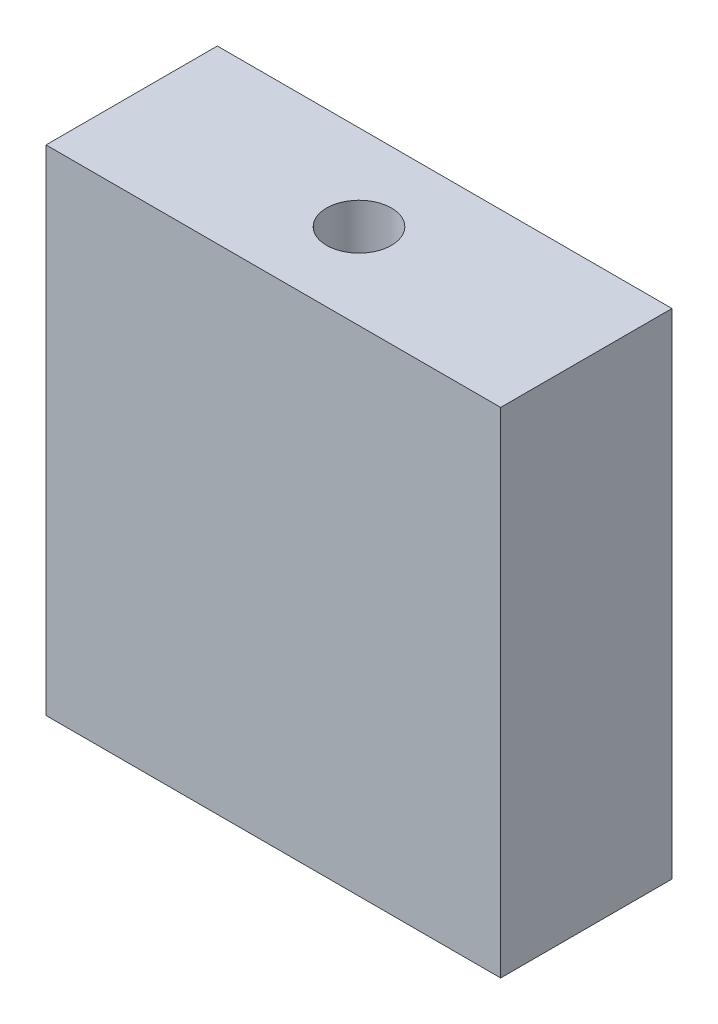
ISO-10303-21;
HEADER;
FILE_DESCRIPTION(('STEP AP214'),'2;1');
FILE_NAME('part.step','',(''),(''),'','','');
FILE_SCHEMA(('AUTOMOTIVE_DESIGN { 1 0 10303 214 1 1 1 1 }'));
ENDSEC;
DATA;
#1=APPLICATION_CONTEXT('core data for automotive mechanical design processes');
#2=APPLICATION_PROTOCOL_DEFINITION('international standard','automotive_design',2000,#1);
#3=PRODUCT_CONTEXT('',#1,'mechanical');
#4=PRODUCT('Part','Part','',(#3));
#5=PRODUCT_RELATED_PRODUCT_CATEGORY('part','',(#4));
#6=PRODUCT_DEFINITION_FORMATION('','',#4);
#7=PRODUCT_DEFINITION_CONTEXT('part definition',#1,'design');
#8=PRODUCT_DEFINITION('design','',#6,#7);
#9=PRODUCT_DEFINITION_SHAPE('','',#8);
#10=(LENGTH_UNIT() NAMED_UNIT(*) SI_UNIT(.MILLI.,.METRE.));
#11=(NAMED_UNIT(*) PLANE_ANGLE_UNIT() SI_UNIT($,.RADIAN.));
#12=(NAMED_UNIT(*) SI_UNIT($,.STERADIAN.) SOLID_ANGLE_UNIT());
#13=UNCERTAINTY_MEASURE_WITH_UNIT(LENGTH_MEASURE(1.E-05),#10,'distance_accuracy_value','');
#14=(GEOMETRIC_REPRESENTATION_CONTEXT(3) GLOBAL_UNCERTAINTY_ASSIGNED_CONTEXT((#13)) GLOBAL_UNIT_ASSIGNED_CONTEXT((#10,
#11,#12)) REPRESENTATION_CONTEXT('',''));
#15=CARTESIAN_POINT('',(0.,0.,0.));
#16=DIRECTION('',(0.,0.,1.));
#17=DIRECTION('',(1.,0.,0.));
#18=AXIS2_PLACEMENT_3D('',#15,#16,#17);
#19=CARTESIAN_POINT('',(-8.763,-9.525,6.604));
#20=DIRECTION('',(1.,0.,0.));
#21=DIRECTION('',(0.,0.,-1.));
#22=AXIS2_PLACEMENT_3D('',#19,#20,#21);
#23=PLANE('',#22);
#24=DIRECTION('',(0.,-1.,0.));
#25=VECTOR('',#24,1.);
#26=CARTESIAN_POINT('',(-8.763,-9.525,0.));
#27=LINE('',#26,#25);
#28=CARTESIAN_POINT('',(-8.763,9.525,0.));
#29=VERTEX_POINT('',#28);
#30=CARTESIAN_POINT('',(-8.763,-9.525,0.));
#31=VERTEX_POINT('',#30);
#32=EDGE_CURVE('E117',#29,#31,#27,.T.);
#33=ORIENTED_EDGE('',*,*,#32,.T.);
#34=DIRECTION('',(0.,0.,-1.));
#35=VECTOR('',#34,1.);
#36=CARTESIAN_POINT('',(-8.763,-9.525,6.604));
#37=LINE('',#36,#35);
#38=CARTESIAN_POINT('',(-8.763,-9.525,6.604));
#39=VERTEX_POINT('',#38);
#40=EDGE_CURVE('E11',#39,#31,#37,.T.);
#41=ORIENTED_EDGE('',*,*,#40,.F.);
#42=DIRECTION('',(0.,-1.,0.));
#43=VECTOR('',#42,1.);
#44=CARTESIAN_POINT('',(-8.763,-9.525,6.604));
#45=LINE('',#44,#43);
#46=CARTESIAN_POINT('',(-8.763,9.525,6.604));
#47=VERTEX_POINT('',#46);
#48=EDGE_CURVE('E118',#47,#39,#45,.T.);
#49=ORIENTED_EDGE('',*,*,#48,.F.);
#50=DIRECTION('',(0.,0.,-1.));
#51=VECTOR('',#50,1.);
#52=CARTESIAN_POINT('',(-8.763,9.525,6.604));
#53=LINE('',#52,#51);
#54=EDGE_CURVE('E124',#47,#29,#53,.T.);
#55=ORIENTED_EDGE('',*,*,#54,.T.);
#56=EDGE_LOOP('',(#33,#41,#49,#55));
#57=FACE_BOUND('',#56,.T.);
#58=ADVANCED_FACE('F42',(#57),#23,.F.);
#59=CARTESIAN_POINT('',(8.763,-9.525,6.604));
#60=DIRECTION('',(0.,1.,0.));
#61=DIRECTION('',(-1.,0.,0.));
#62=AXIS2_PLACEMENT_3D('',#59,#60,#61);
#63=PLANE('',#62);
#64=CARTESIAN_POINT('',(0.,-9.525,3.302));
#65=DIRECTION('',(0.,-1.,0.));
#66=DIRECTION('',(0.,0.,-1.));
#67=AXIS2_PLACEMENT_3D('',#64,#65,#66);
#68=CIRCLE('',#67,1.24999999999999);
#69=CARTESIAN_POINT('',(0.,-9.525,2.05200000000001));
#70=VERTEX_POINT('',#69);
#71=EDGE_CURVE('E107',#70,#70,#68,.T.);
#72=ORIENTED_EDGE('',*,*,#71,.F.);
#73=EDGE_LOOP('',(#72));
#74=FACE_BOUND('',#73,.T.);
#75=DIRECTION('',(1.,0.,0.));
#76=VECTOR('',#75,1.);
#77=CARTESIAN_POINT('',(8.763,-9.525,0.));
#78=LINE('',#77,#76);
#79=CARTESIAN_POINT('',(8.763,-9.525,0.));
#80=VERTEX_POINT('',#79);
#81=EDGE_CURVE('E127',#31,#80,#78,.T.);
#82=ORIENTED_EDGE('',*,*,#81,.T.);
#83=DIRECTION('',(0.,0.,-1.));
#84=VECTOR('',#83,1.);
#85=CARTESIAN_POINT('',(8.763,-9.525,6.604));
#86=LINE('',#85,#84);
#87=CARTESIAN_POINT('',(8.763,-9.525,6.604));
#88=VERTEX_POINT('',#87);
#89=EDGE_CURVE('E50',#88,#80,#86,.T.);
#90=ORIENTED_EDGE('',*,*,#89,.F.);
#91=DIRECTION('',(1.,0.,0.));
#92=VECTOR('',#91,1.);
#93=CARTESIAN_POINT('',(8.763,-9.525,6.604));
#94=LINE('',#93,#92);
#95=EDGE_CURVE('E89',#39,#88,#94,.T.);
#96=ORIENTED_EDGE('',*,*,#95,.F.);
#97=ORIENTED_EDGE('',*,*,#40,.T.);
#98=EDGE_LOOP('',(#82,#90,#96,#97));
#99=FACE_BOUND('',#98,.T.);
#100=ADVANCED_FACE('F151',(#74,#99),#63,.F.);
#101=CARTESIAN_POINT('',(8.763,-9.525,6.604));
#102=DIRECTION('',(-1.,0.,0.));
#103=DIRECTION('',(0.,0.,1.));
#104=AXIS2_PLACEMENT_3D('',#101,#102,#103);
#105=PLANE('',#104);
#106=DIRECTION('',(0.,1.,0.));
#107=VECTOR('',#106,1.);
#108=CARTESIAN_POINT('',(8.763,-9.525,0.));
#109=LINE('',#108,#107);
#110=CARTESIAN_POINT('',(8.763,9.525,0.));
#111=VERTEX_POINT('',#110);
#112=EDGE_CURVE('E76',#80,#111,#109,.T.);
#113=ORIENTED_EDGE('',*,*,#112,.T.);
#114=DIRECTION('',(0.,0.,-1.));
#115=VECTOR('',#114,1.);
#116=CARTESIAN_POINT('',(8.763,9.525,6.604));
#117=LINE('',#116,#115);
#118=CARTESIAN_POINT('',(8.763,9.525,6.604));
#119=VERTEX_POINT('',#118);
#120=EDGE_CURVE('E132',#119,#111,#117,.T.);
#121=ORIENTED_EDGE('',*,*,#120,.F.);
#122=DIRECTION('',(0.,1.,0.));
#123=VECTOR('',#122,1.);
#124=CARTESIAN_POINT('',(8.763,-9.525,6.604));
#125=LINE('',#124,#123);
#126=EDGE_CURVE('E121',#88,#119,#125,.T.);
#127=ORIENTED_EDGE('',*,*,#126,.F.);
#128=ORIENTED_EDGE('',*,*,#89,.T.);
#129=EDGE_LOOP('',(#113,#121,#127,#128));
#130=FACE_BOUND('',#129,.T.);
#131=ADVANCED_FACE('F134',(#130),#105,.F.);
#132=CARTESIAN_POINT('',(8.763,9.525,6.604));
#133=DIRECTION('',(0.,-1.,0.));
#134=DIRECTION('',(1.,0.,0.));
#135=AXIS2_PLACEMENT_3D('',#132,#133,#134);
#136=PLANE('',#135);
#137=CARTESIAN_POINT('',(0.,9.525,3.302));
#138=DIRECTION('',(0.,1.,0.));
#139=DIRECTION('',(0.,0.,1.));
#140=AXIS2_PLACEMENT_3D('',#137,#138,#139);
#141=CIRCLE('',#140,1.25);
#142=CARTESIAN_POINT('',(0.,9.525,4.552));
#143=VERTEX_POINT('',#142);
#144=EDGE_CURVE('E106',#143,#143,#141,.T.);
#145=ORIENTED_EDGE('',*,*,#144,.F.);
#146=EDGE_LOOP('',(#145));
#147=FACE_BOUND('',#146,.T.);
#148=DIRECTION('',(-1.,0.,0.));
#149=VECTOR('',#148,1.);
#150=CARTESIAN_POINT('',(8.763,9.525,0.));
#151=LINE('',#150,#149);
#152=EDGE_CURVE('E82',#111,#29,#151,.T.);
#153=ORIENTED_EDGE('',*,*,#152,.T.);
#154=ORIENTED_EDGE('',*,*,#54,.F.);
#155=DIRECTION('',(-1.,0.,0.));
#156=VECTOR('',#155,1.);
#157=CARTESIAN_POINT('',(8.763,9.525,6.604));
#158=LINE('',#157,#156);
#159=EDGE_CURVE('E58',#119,#47,#158,.T.);
#160=ORIENTED_EDGE('',*,*,#159,.F.);
#161=ORIENTED_EDGE('',*,*,#120,.T.);
#162=EDGE_LOOP('',(#153,#154,#160,#161));
#163=FACE_BOUND('',#162,.T.);
#164=ADVANCED_FACE('F141',(#147,#163),#136,.F.);
#165=CARTESIAN_POINT('',(0.,0.,6.604));
#166=DIRECTION('',(0.,0.,1.));
#167=DIRECTION('',(1.,0.,0.));
#168=AXIS2_PLACEMENT_3D('',#165,#166,#167);
#169=PLANE('',#168);
#170=ORIENTED_EDGE('',*,*,#48,.T.);
#171=ORIENTED_EDGE('',*,*,#95,.T.);
#172=ORIENTED_EDGE('',*,*,#126,.T.);
#173=ORIENTED_EDGE('',*,*,#159,.T.);
#174=EDGE_LOOP('',(#170,#171,#172,#173));
#175=FACE_BOUND('',#174,.T.);
#176=ADVANCED_FACE('F143',(#175),#169,.T.);
#177=CARTESIAN_POINT('',(0.,0.,0.));
#178=DIRECTION('',(0.,0.,1.));
#179=DIRECTION('',(1.,0.,0.));
#180=AXIS2_PLACEMENT_3D('',#177,#178,#179);
#181=PLANE('',#180);
#182=ORIENTED_EDGE('',*,*,#32,.F.);
#183=ORIENTED_EDGE('',*,*,#152,.F.);
#184=ORIENTED_EDGE('',*,*,#112,.F.);
#185=ORIENTED_EDGE('',*,*,#81,.F.);
#186=EDGE_LOOP('',(#182,#183,#184,#185));
#187=FACE_BOUND('',#186,.T.);
#188=ADVANCED_FACE('F137',(#187),#181,.F.);
#189=CARTESIAN_POINT('',(0.,2.032,3.302));
#190=DIRECTION('',(0.,1.,0.));
#191=DIRECTION('',(0.,0.,1.));
#192=AXIS2_PLACEMENT_3D('',#189,#190,#191);
#193=CONICAL_SURFACE('',#192,1.25,1.02974425867665);
#194=CARTESIAN_POINT('',(0.,1.28092422621555,3.302));
#195=VERTEX_POINT('',#194);
#196=VERTEX_LOOP('',#195);
#197=FACE_BOUND('',#196,.T.);
#198=CARTESIAN_POINT('',(0.,2.032,3.302));
#199=DIRECTION('',(0.,1.,0.));
#200=DIRECTION('',(0.,0.,1.));
#201=AXIS2_PLACEMENT_3D('',#198,#199,#200);
#202=CIRCLE('',#201,1.25);
#203=CARTESIAN_POINT('',(0.,2.032,4.552));
#204=VERTEX_POINT('',#203);
#205=EDGE_CURVE('E110',#204,#204,#202,.T.);
#206=ORIENTED_EDGE('',*,*,#205,.T.);
#207=EDGE_LOOP('',(#206));
#208=FACE_BOUND('',#207,.T.);
#209=ADVANCED_FACE('F171',(#197,#208),#193,.F.);
#210=CARTESIAN_POINT('',(0.,9.525,3.302));
#211=DIRECTION('',(0.,1.,0.));
#212=DIRECTION('',(0.,0.,1.));
#213=AXIS2_PLACEMENT_3D('',#210,#211,#212);
#214=CYLINDRICAL_SURFACE('',#213,1.25);
#215=ORIENTED_EDGE('',*,*,#205,.F.);
#216=EDGE_LOOP('',(#215));
#217=FACE_BOUND('',#216,.T.);
#218=ORIENTED_EDGE('',*,*,#144,.T.);
#219=EDGE_LOOP('',(#218));
#220=FACE_BOUND('',#219,.T.);
#221=ADVANCED_FACE('F100',(#217,#220),#214,.F.);
#222=CARTESIAN_POINT('',(0.,-2.032,3.302));
#223=DIRECTION('',(0.,-1.,0.));
#224=DIRECTION('',(0.,0.,-1.));
#225=AXIS2_PLACEMENT_3D('',#222,#223,#224);
#226=CONICAL_SURFACE('',#225,1.24999999999999,1.02974425867665);
#227=CARTESIAN_POINT('',(0.,-1.28092422621556,3.302));
#228=VERTEX_POINT('',#227);
#229=VERTEX_LOOP('',#228);
#230=FACE_BOUND('',#229,.T.);
#231=CARTESIAN_POINT('',(0.,-2.032,3.302));
#232=DIRECTION('',(0.,-1.,0.));
#233=DIRECTION('',(0.,0.,-1.));
#234=AXIS2_PLACEMENT_3D('',#231,#232,#233);
#235=CIRCLE('',#234,1.24999999999999);
#236=CARTESIAN_POINT('',(0.,-2.032,2.05200000000001));
#237=VERTEX_POINT('',#236);
#238=EDGE_CURVE('E104',#237,#237,#235,.T.);
#239=ORIENTED_EDGE('',*,*,#238,.T.);
#240=EDGE_LOOP('',(#239));
#241=FACE_BOUND('',#240,.T.);
#242=ADVANCED_FACE('F96',(#230,#241),#226,.F.);
#243=CARTESIAN_POINT('',(0.,-9.525,3.302));
#244=DIRECTION('',(0.,-1.,0.));
#245=DIRECTION('',(0.,0.,-1.));
#246=AXIS2_PLACEMENT_3D('',#243,#244,#245);
#247=CYLINDRICAL_SURFACE('',#246,1.24999999999999);
#248=ORIENTED_EDGE('',*,*,#238,.F.);
#249=EDGE_LOOP('',(#248));
#250=FACE_BOUND('',#249,.T.);
#251=ORIENTED_EDGE('',*,*,#71,.T.);
#252=EDGE_LOOP('',(#251));
#253=FACE_BOUND('',#252,.T.);
#254=ADVANCED_FACE('F99',(#250,#253),#247,.F.);
#255=CLOSED_SHELL('',(#58,#100,#131,#164,#176,#188,#209,#221,#242,#254));
#256=MANIFOLD_SOLID_BREP('B2',#255);
#257=ADVANCED_BREP_SHAPE_REPRESENTATION('',(#18,#256),#14);
#258=SHAPE_DEFINITION_REPRESENTATION(#9,#257);
ENDSEC;
END-ISO-10303-21;
